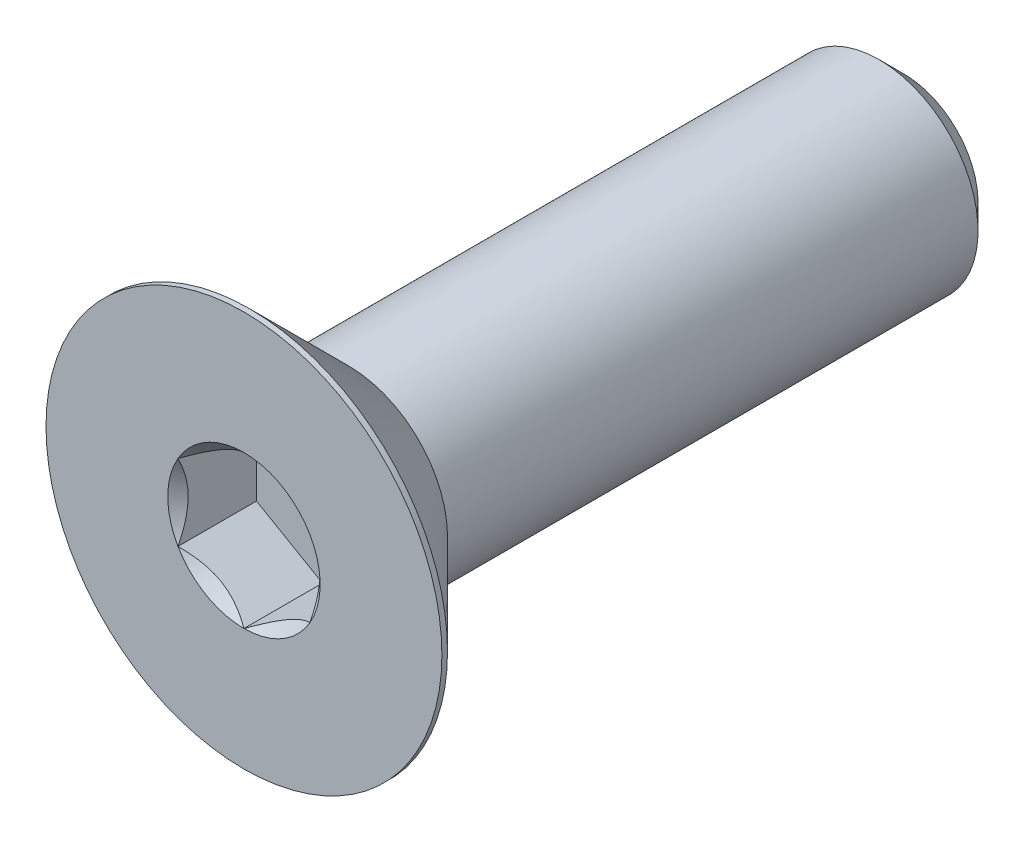
ISO-10303-21;
HEADER;
FILE_DESCRIPTION(('STEP AP214'),'2;1');
FILE_NAME('part.step','',(''),(''),'','','');
FILE_SCHEMA(('AUTOMOTIVE_DESIGN { 1 0 10303 214 1 1 1 1 }'));
ENDSEC;
DATA;
#1=APPLICATION_CONTEXT('core data for automotive mechanical design processes');
#2=APPLICATION_PROTOCOL_DEFINITION('international standard','automotive_design',2000,#1);
#3=PRODUCT_CONTEXT('',#1,'mechanical');
#4=PRODUCT('Part','Part','',(#3));
#5=PRODUCT_RELATED_PRODUCT_CATEGORY('part','',(#4));
#6=PRODUCT_DEFINITION_FORMATION('','',#4);
#7=PRODUCT_DEFINITION_CONTEXT('part definition',#1,'design');
#8=PRODUCT_DEFINITION('design','',#6,#7);
#9=PRODUCT_DEFINITION_SHAPE('','',#8);
#10=(LENGTH_UNIT() NAMED_UNIT(*) SI_UNIT(.MILLI.,.METRE.));
#11=(NAMED_UNIT(*) PLANE_ANGLE_UNIT() SI_UNIT($,.RADIAN.));
#12=(NAMED_UNIT(*) SI_UNIT($,.STERADIAN.) SOLID_ANGLE_UNIT());
#13=UNCERTAINTY_MEASURE_WITH_UNIT(LENGTH_MEASURE(1.E-05),#10,'distance_accuracy_value','');
#14=(GEOMETRIC_REPRESENTATION_CONTEXT(3) GLOBAL_UNCERTAINTY_ASSIGNED_CONTEXT((#13)) GLOBAL_UNIT_ASSIGNED_CONTEXT((#10,
#11,#12)) REPRESENTATION_CONTEXT('',''));
#15=CARTESIAN_POINT('',(0.,0.,0.));
#16=DIRECTION('',(0.,0.,1.));
#17=DIRECTION('',(1.,0.,0.));
#18=AXIS2_PLACEMENT_3D('',#15,#16,#17);
#19=CARTESIAN_POINT('',(0.,0.,5.));
#20=DIRECTION('',(0.,0.,-1.));
#21=DIRECTION('',(0.,1.,0.));
#22=AXIS2_PLACEMENT_3D('',#19,#20,#21);
#23=PLANE('',#22);
#24=CARTESIAN_POINT('',(0.,0.,5.));
#25=DIRECTION('',(0.,0.,1.));
#26=DIRECTION('',(0.,-1.,0.));
#27=AXIS2_PLACEMENT_3D('',#24,#25,#26);
#28=CIRCLE('',#27,3.);
#29=CARTESIAN_POINT('',(0.,-3.,5.));
#30=VERTEX_POINT('',#29);
#31=EDGE_CURVE('E232',#30,#30,#28,.T.);
#32=ORIENTED_EDGE('',*,*,#31,.T.);
#33=EDGE_LOOP('',(#32));
#34=FACE_BOUND('',#33,.T.);
#35=CARTESIAN_POINT('',(0.,0.,5.));
#36=DIRECTION('',(0.,0.,-1.));
#37=DIRECTION('',(-1.,0.,0.));
#38=AXIS2_PLACEMENT_3D('',#35,#36,#37);
#39=CIRCLE('',#38,1.15470053837925);
#40=CARTESIAN_POINT('',(-1.,0.577350269189623,5.));
#41=VERTEX_POINT('',#40);
#42=CARTESIAN_POINT('',(0.,1.15470053837925,5.));
#43=VERTEX_POINT('',#42);
#44=EDGE_CURVE('E146',#41,#43,#39,.T.);
#45=ORIENTED_EDGE('',*,*,#44,.T.);
#46=CARTESIAN_POINT('',(1.,0.577350269189625,5.));
#47=VERTEX_POINT('',#46);
#48=EDGE_CURVE('E145',#43,#47,#39,.T.);
#49=ORIENTED_EDGE('',*,*,#48,.T.);
#50=CARTESIAN_POINT('',(1.,-0.577350269189626,5.));
#51=VERTEX_POINT('',#50);
#52=EDGE_CURVE('E117',#47,#51,#39,.T.);
#53=ORIENTED_EDGE('',*,*,#52,.T.);
#54=CARTESIAN_POINT('',(0.,-1.15470053837925,5.));
#55=VERTEX_POINT('',#54);
#56=EDGE_CURVE('E110',#51,#55,#39,.T.);
#57=ORIENTED_EDGE('',*,*,#56,.T.);
#58=CARTESIAN_POINT('',(-1.,-0.577350269189627,5.));
#59=VERTEX_POINT('',#58);
#60=EDGE_CURVE('E71',#55,#59,#39,.T.);
#61=ORIENTED_EDGE('',*,*,#60,.T.);
#62=EDGE_CURVE('E78',#59,#41,#39,.T.);
#63=ORIENTED_EDGE('',*,*,#62,.T.);
#64=EDGE_LOOP('',(#45,#49,#53,#57,#61,#63));
#65=FACE_BOUND('',#64,.T.);
#66=ADVANCED_FACE('F51',(#34,#65),#23,.F.);
#67=CARTESIAN_POINT('',(0.,0.,4.915));
#68=DIRECTION('',(0.,0.,1.));
#69=DIRECTION('',(0.,-1.,0.));
#70=AXIS2_PLACEMENT_3D('',#67,#68,#69);
#71=CONICAL_SURFACE('',#70,3.,0.785398163397448);
#72=CARTESIAN_POINT('',(0.,0.,3.3));
#73=DIRECTION('',(0.,0.,1.));
#74=DIRECTION('',(0.,-1.,0.));
#75=AXIS2_PLACEMENT_3D('',#72,#73,#74);
#76=CIRCLE('',#75,1.385);
#77=CARTESIAN_POINT('',(0.,-1.385,3.3));
#78=VERTEX_POINT('',#77);
#79=EDGE_CURVE('E233',#78,#78,#76,.T.);
#80=ORIENTED_EDGE('',*,*,#79,.T.);
#81=EDGE_LOOP('',(#80));
#82=FACE_BOUND('',#81,.T.);
#83=CARTESIAN_POINT('',(0.,0.,4.915));
#84=DIRECTION('',(0.,0.,1.));
#85=DIRECTION('',(0.,-1.,0.));
#86=AXIS2_PLACEMENT_3D('',#83,#84,#85);
#87=CIRCLE('',#86,3.);
#88=CARTESIAN_POINT('',(0.,-3.,4.915));
#89=VERTEX_POINT('',#88);
#90=EDGE_CURVE('E65',#89,#89,#87,.T.);
#91=ORIENTED_EDGE('',*,*,#90,.F.);
#92=EDGE_LOOP('',(#91));
#93=FACE_BOUND('',#92,.T.);
#94=ADVANCED_FACE('F53',(#82,#93),#71,.T.);
#95=CARTESIAN_POINT('',(0.,0.,5.));
#96=DIRECTION('',(0.,0.,1.));
#97=DIRECTION('',(0.,-1.,0.));
#98=AXIS2_PLACEMENT_3D('',#95,#96,#97);
#99=CYLINDRICAL_SURFACE('',#98,3.);
#100=ORIENTED_EDGE('',*,*,#90,.T.);
#101=EDGE_LOOP('',(#100));
#102=FACE_BOUND('',#101,.T.);
#103=ORIENTED_EDGE('',*,*,#31,.F.);
#104=EDGE_LOOP('',(#103));
#105=FACE_BOUND('',#104,.T.);
#106=ADVANCED_FACE('F217',(#102,#105),#99,.T.);
#107=CARTESIAN_POINT('',(0.,0.,3.3));
#108=DIRECTION('',(0.,0.,-1.));
#109=DIRECTION('',(0.,1.,0.));
#110=AXIS2_PLACEMENT_3D('',#107,#108,#109);
#111=PLANE('',#110);
#112=ORIENTED_EDGE('',*,*,#79,.F.);
#113=EDGE_LOOP('',(#112));
#114=FACE_BOUND('',#113,.T.);
#115=ADVANCED_FACE('F221',(#114),#111,.T.);
#116=CARTESIAN_POINT('',(0.,0.,5.));
#117=DIRECTION('',(0.,0.,1.));
#118=DIRECTION('',(-1.,0.,0.));
#119=AXIS2_PLACEMENT_3D('',#116,#117,#118);
#120=CONICAL_SURFACE('',#119,1.15470053837925,0.78539816339745);
#121=CARTESIAN_POINT('',(1.,-1.15147208646462,5.37038567751387));
#122=CARTESIAN_POINT('',(1.,-1.12343447988552,5.34921991987372));
#123=CARTESIAN_POINT('',(1.,-1.09524064850697,5.32826169217592));
#124=CARTESIAN_POINT('',(1.,-1.03847715644377,5.28684602223563));
#125=CARTESIAN_POINT('',(1.,-1.00990740382975,5.26638870612366));
#126=CARTESIAN_POINT('',(1.,-0.92312089433348,5.20560479495451));
#127=CARTESIAN_POINT('',(1.,-0.864253173759063,5.1661922289614));
#128=CARTESIAN_POINT('',(1.,-0.740809858258048,5.08882066420021));
#129=CARTESIAN_POINT('',(1.,-0.67610025513781,5.05107303911435));
#130=CARTESIAN_POINT('',(1.,-0.543448939049126,4.9820245875513));
#131=CARTESIAN_POINT('',(1.,-0.475519112027781,4.95070202784687));
#132=CARTESIAN_POINT('',(1.,-0.37355585033353,4.9123817788838));
#133=CARTESIAN_POINT('',(1.,-0.341031989670909,4.90138359164216));
#134=CARTESIAN_POINT('',(1.,-0.275199079052294,4.88199834214736));
#135=CARTESIAN_POINT('',(1.,-0.241889975173934,4.8736114597767));
#136=CARTESIAN_POINT('',(1.,-0.175247517042993,4.86002522071902));
#137=CARTESIAN_POINT('',(1.,-0.141925568218175,4.85477079076797));
#138=CARTESIAN_POINT('',(1.,-0.0749144362322792,4.8475486865709));
#139=CARTESIAN_POINT('',(1.,-0.0412251978501618,4.84558151361051));
#140=CARTESIAN_POINT('',(1.,0.0249580992634212,4.84508319839316));
#141=CARTESIAN_POINT('',(1.,0.0574512826460395,4.84643026788864));
#142=CARTESIAN_POINT('',(1.,0.122148505701867,4.85221648449899));
#143=CARTESIAN_POINT('',(1.,0.154352610132927,4.85665492066154));
#144=CARTESIAN_POINT('',(1.,0.21879989886764,4.86845683014521));
#145=CARTESIAN_POINT('',(1.,0.251033743268954,4.87587054103851));
#146=CARTESIAN_POINT('',(1.,0.31479713235492,4.89322894249868));
#147=CARTESIAN_POINT('',(1.,0.346326735731005,4.90317342128883));
#148=CARTESIAN_POINT('',(1.,0.445594187730206,4.93822348255434));
#149=CARTESIAN_POINT('',(1.,0.511919139476037,4.96732085835673));
#150=CARTESIAN_POINT('',(1.,0.641453244657533,5.03201532968651));
#151=CARTESIAN_POINT('',(1.,0.704650133126345,5.06763577671525));
#152=CARTESIAN_POINT('',(1.,0.825428490174987,5.14112390134694));
#153=CARTESIAN_POINT('',(1.,0.883132947867686,5.17879194713547));
#154=CARTESIAN_POINT('',(1.,0.968148853704567,5.23702285294317));
#155=CARTESIAN_POINT('',(1.,0.996120570380286,5.25663847576286));
#156=CARTESIAN_POINT('',(1.,1.05168177729902,5.29638851706128));
#157=CARTESIAN_POINT('',(1.,1.079271369977,5.31652279219884));
#158=CARTESIAN_POINT('',(1.,1.10670185346329,5.33687211907298));
#159=B_SPLINE_CURVE_WITH_KNOTS('',3,(#121,#122,#123,#124,#125,#126,#127,#128,#129,#130,#131,
#132,#133,#134,#135,#136,#137,#138,#139,#140,#141,#142,#143,#144,#145,#146,#147,#148,#149,#150,
#151,#152,#153,#154,#155,#156,#157,#158),.UNSPECIFIED.,.F.,.F.,(4,2,2,2,2,2,2,2,2,2,2,2,2,2,2,2,
2,2,4),(0.,0.105386459083291,0.210799187330125,0.423233611565469,0.647793540908504,
0.871580877738612,0.974493074181424,1.07741235827201,1.17846428203205,1.27953161415763,
1.37694086739611,1.47432772585408,1.57343322804294,1.67253043972852,1.88917353996828,
2.10660791038813,2.31323734249844,2.41572589232045,2.51818641476504),.UNSPECIFIED.);
#160=EDGE_CURVE('E12',#47,#51,#159,.F.);
#161=ORIENTED_EDGE('',*,*,#160,.T.);
#162=ORIENTED_EDGE('',*,*,#52,.F.);
#163=EDGE_LOOP('',(#161,#162));
#164=FACE_BOUND('',#163,.T.);
#165=ADVANCED_FACE('F122',(#164),#120,.F.);
#166=CARTESIAN_POINT('',(-0.000199999999999349,1.15481600843309,5.00011548737262));
#167=CARTESIAN_POINT('',(0.0341825950071816,1.13496520795026,4.98027793082573));
#168=CARTESIAN_POINT('',(0.0691401181398258,1.11478247255942,4.96160502063889));
#169=CARTESIAN_POINT('',(0.140422802956091,1.07362739529219,4.92741474272316));
#170=CARTESIAN_POINT('',(0.176754750528985,1.0526511355808,4.91191640902346));
#171=CARTESIAN_POINT('',(0.250016613803312,1.01035337909803,4.88536730714227));
#172=CARTESIAN_POINT('',(0.286927851445415,0.989042666109241,4.87424977399693));
#173=CARTESIAN_POINT('',(0.36156272931086,0.945952199282691,4.85711986577618));
#174=CARTESIAN_POINT('',(0.399284088108636,0.924173762626597,4.85109469746668));
#175=CARTESIAN_POINT('',(0.464292198417934,0.886641312640015,4.8456605549675));
#176=CARTESIAN_POINT('',(0.491494371528173,0.870936130672276,4.84485693831673));
#177=CARTESIAN_POINT('',(0.545846040669112,0.839556179862849,4.84620669941689));
#178=CARTESIAN_POINT('',(0.572995523754876,0.823881418494924,4.8483607295472));
#179=CARTESIAN_POINT('',(0.654056277326961,0.777080970599367,4.85911697212847));
#180=CARTESIAN_POINT('',(0.707564140978428,0.74618819111643,4.87201455641536));
#181=CARTESIAN_POINT('',(0.801476065143433,0.69196811641965,4.90314073060218));
#182=CARTESIAN_POINT('',(0.842320523671835,0.668386557293372,4.91973779770184));
#183=CARTESIAN_POINT('',(0.922409637381945,0.622147085933681,4.9571249246853));
#184=CARTESIAN_POINT('',(0.961659010870439,0.599486449584575,4.97790134181741));
#185=CARTESIAN_POINT('',(1.0002,0.577234799135788,5.00011548737262));
#186=B_SPLINE_CURVE_WITH_KNOTS('',3,(#166,#167,#168,#169,#170,#171,#172,#173,#174,#175,#176,
#177,#178,#179,#180,#181,#182,#183,#184,#185),.UNSPECIFIED.,.F.,.F.,(4,2,2,2,2,2,2,2,2,4),(0.,
0.133237676828559,0.26725222983449,0.3991370762693,0.530689603280768,0.624814864263846,
0.718960890149133,0.907306626112097,1.05710100361789,1.20641411519286),.UNSPECIFIED.);
#187=EDGE_CURVE('E148',#43,#47,#186,.T.);
#188=ORIENTED_EDGE('',*,*,#187,.T.);
#189=ORIENTED_EDGE('',*,*,#48,.F.);
#190=EDGE_LOOP('',(#188,#189));
#191=FACE_BOUND('',#190,.T.);
#192=ADVANCED_FACE('F271',(#191),#120,.F.);
#193=CARTESIAN_POINT('',(-1.0002,0.577234799135787,5.00011548737262));
#194=CARTESIAN_POINT('',(-0.965817404992821,0.59708559961862,4.98027793082574));
#195=CARTESIAN_POINT('',(-0.930859881860177,0.617268335009455,4.96160502063889));
#196=CARTESIAN_POINT('',(-0.859577197043912,0.658423412276685,4.92741474272316));
#197=CARTESIAN_POINT('',(-0.823245249471017,0.679399671988079,4.91191640902346));
#198=CARTESIAN_POINT('',(-0.74998338619669,0.721697428470845,4.88536730714227));
#199=CARTESIAN_POINT('',(-0.713072148554587,0.743008141459636,4.87424977399693));
#200=CARTESIAN_POINT('',(-0.638437270689141,0.786098608286186,4.85711986577618));
#201=CARTESIAN_POINT('',(-0.600715911891365,0.80787704494228,4.85109469746668));
#202=CARTESIAN_POINT('',(-0.535707801582067,0.845409494928863,4.8456605549675));
#203=CARTESIAN_POINT('',(-0.508505628471828,0.861114676896602,4.84485693831673));
#204=CARTESIAN_POINT('',(-0.454153959330888,0.892494627706029,4.84620669941689));
#205=CARTESIAN_POINT('',(-0.427004476245125,0.908169389073954,4.8483607295472));
#206=CARTESIAN_POINT('',(-0.34594372267304,0.95496983696951,4.85911697212847));
#207=CARTESIAN_POINT('',(-0.292435859021573,0.985862616452447,4.87201455641536));
#208=CARTESIAN_POINT('',(-0.198523934856569,1.04008269114923,4.90314073060218));
#209=CARTESIAN_POINT('',(-0.157679476328166,1.06366425027551,4.91973779770184));
#210=CARTESIAN_POINT('',(-0.0775903626180558,1.1099037216352,4.9571249246853));
#211=CARTESIAN_POINT('',(-0.0383409891295616,1.1325643579843,4.97790134181741));
#212=CARTESIAN_POINT('',(0.000200000000000833,1.15481600843309,5.00011548737262));
#213=B_SPLINE_CURVE_WITH_KNOTS('',3,(#193,#194,#195,#196,#197,#198,#199,#200,#201,#202,#203,
#204,#205,#206,#207,#208,#209,#210,#211,#212),.UNSPECIFIED.,.F.,.F.,(4,2,2,2,2,2,2,2,2,4),(0.,
0.133237676828559,0.267252229834491,0.399137076269301,0.53068960328077,0.624814864263848,
0.718960890149135,0.907306626112099,1.0571010036179,1.20641411519286),.UNSPECIFIED.);
#214=EDGE_CURVE('E155',#41,#43,#213,.T.);
#215=ORIENTED_EDGE('',*,*,#214,.T.);
#216=ORIENTED_EDGE('',*,*,#44,.F.);
#217=EDGE_LOOP('',(#215,#216));
#218=FACE_BOUND('',#217,.T.);
#219=ADVANCED_FACE('F267',(#218),#120,.F.);
#220=CARTESIAN_POINT('',(-1.,-1.15147208646462,5.37038567751387));
#221=CARTESIAN_POINT('',(-1.,-1.12343447988552,5.34921991987372));
#222=CARTESIAN_POINT('',(-1.,-1.09524064850698,5.32826169217592));
#223=CARTESIAN_POINT('',(-1.,-1.03847715644377,5.28684602223563));
#224=CARTESIAN_POINT('',(-1.,-1.00990740382976,5.26638870612367));
#225=CARTESIAN_POINT('',(-1.,-0.923120894333482,5.20560479495452));
#226=CARTESIAN_POINT('',(-1.,-0.864253173759064,5.1661922289614));
#227=CARTESIAN_POINT('',(-1.,-0.74080985825805,5.08882066420021));
#228=CARTESIAN_POINT('',(-1.,-0.676100255137811,5.05107303911435));
#229=CARTESIAN_POINT('',(-1.,-0.543448939049127,4.9820245875513));
#230=CARTESIAN_POINT('',(-1.,-0.475519112027781,4.95070202784687));
#231=CARTESIAN_POINT('',(-1.,-0.373555850333531,4.9123817788838));
#232=CARTESIAN_POINT('',(-1.,-0.34103198967091,4.90138359164216));
#233=CARTESIAN_POINT('',(-1.,-0.275199079052295,4.88199834214736));
#234=CARTESIAN_POINT('',(-1.,-0.241889975173935,4.8736114597767));
#235=CARTESIAN_POINT('',(-1.,-0.175247517042994,4.86002522071902));
#236=CARTESIAN_POINT('',(-1.,-0.141925568218176,4.85477079076797));
#237=CARTESIAN_POINT('',(-1.,-0.0749144362322802,4.8475486865709));
#238=CARTESIAN_POINT('',(-1.,-0.041225197850163,4.84558151361051));
#239=CARTESIAN_POINT('',(-1.,0.0249580992634198,4.84508319839316));
#240=CARTESIAN_POINT('',(-1.,0.0574512826460382,4.84643026788864));
#241=CARTESIAN_POINT('',(-1.,0.122148505701866,4.85221648449899));
#242=CARTESIAN_POINT('',(-1.,0.154352610132925,4.85665492066154));
#243=CARTESIAN_POINT('',(-1.,0.218799898867639,4.86845683014521));
#244=CARTESIAN_POINT('',(-1.,0.251033743268953,4.87587054103851));
#245=CARTESIAN_POINT('',(-1.,0.314797132354919,4.89322894249868));
#246=CARTESIAN_POINT('',(-1.,0.346326735731004,4.90317342128883));
#247=CARTESIAN_POINT('',(-1.,0.445594187730205,4.93822348255434));
#248=CARTESIAN_POINT('',(-1.,0.511919139476036,4.96732085835673));
#249=CARTESIAN_POINT('',(-1.,0.641453244657532,5.03201532968651));
#250=CARTESIAN_POINT('',(-1.,0.704650133126344,5.06763577671524));
#251=CARTESIAN_POINT('',(-1.,0.825428490174986,5.14112390134694));
#252=CARTESIAN_POINT('',(-1.,0.883132947867684,5.17879194713547));
#253=CARTESIAN_POINT('',(-1.,0.968148853704565,5.23702285294317));
#254=CARTESIAN_POINT('',(-1.,0.996120570380285,5.25663847576286));
#255=CARTESIAN_POINT('',(-1.,1.05168177729901,5.29638851706127));
#256=CARTESIAN_POINT('',(-1.,1.079271369977,5.31652279219883));
#257=CARTESIAN_POINT('',(-1.,1.10670185346329,5.33687211907297));
#258=B_SPLINE_CURVE_WITH_KNOTS('',3,(#220,#221,#222,#223,#224,#225,#226,#227,#228,#229,#230,
#231,#232,#233,#234,#235,#236,#237,#238,#239,#240,#241,#242,#243,#244,#245,#246,#247,#248,#249,
#250,#251,#252,#253,#254,#255,#256,#257),.UNSPECIFIED.,.F.,.F.,(4,2,2,2,2,2,2,2,2,2,2,2,2,2,2,2,
2,2,4),(0.,0.105386459083291,0.210799187330125,0.423233611565471,0.647793540908507,
0.871580877738615,0.974493074181426,1.07741235827202,1.17846428203205,1.27953161415763,
1.37694086739611,1.47432772585408,1.57343322804294,1.67253043972852,1.88917353996828,
2.10660791038814,2.31323734249844,2.41572589232045,2.51818641476504),.UNSPECIFIED.);
#259=EDGE_CURVE('E175',#59,#41,#258,.T.);
#260=ORIENTED_EDGE('',*,*,#259,.T.);
#261=ORIENTED_EDGE('',*,*,#62,.F.);
#262=EDGE_LOOP('',(#260,#261));
#263=FACE_BOUND('',#262,.T.);
#264=ADVANCED_FACE('F276',(#263),#120,.F.);
#265=CARTESIAN_POINT('',(0.000199999999999969,-1.15481600843309,5.00011548737262));
#266=CARTESIAN_POINT('',(-0.0341825950071806,-1.13496520795026,4.98027793082574));
#267=CARTESIAN_POINT('',(-0.0691401181398248,-1.11478247255942,4.96160502063889));
#268=CARTESIAN_POINT('',(-0.14042280295609,-1.0736273952922,4.92741474272316));
#269=CARTESIAN_POINT('',(-0.176754750528985,-1.0526511355808,4.91191640902346));
#270=CARTESIAN_POINT('',(-0.250016613803312,-1.01035337909803,4.88536730714227));
#271=CARTESIAN_POINT('',(-0.286927851445415,-0.989042666109244,4.87424977399693));
#272=CARTESIAN_POINT('',(-0.36156272931086,-0.945952199282694,4.85711986577619));
#273=CARTESIAN_POINT('',(-0.399284088108637,-0.9241737626266,4.85109469746668));
#274=CARTESIAN_POINT('',(-0.464292198417935,-0.886641312640018,4.8456605549675));
#275=CARTESIAN_POINT('',(-0.491494371528173,-0.870936130672279,4.84485693831674));
#276=CARTESIAN_POINT('',(-0.545846040669113,-0.839556179862851,4.84620669941689));
#277=CARTESIAN_POINT('',(-0.572995523754877,-0.823881418494927,4.84836072954721));
#278=CARTESIAN_POINT('',(-0.654056277326962,-0.77708097059937,4.85911697212848));
#279=CARTESIAN_POINT('',(-0.707564140978429,-0.746188191116433,4.87201455641536));
#280=CARTESIAN_POINT('',(-0.801476065143434,-0.691968116419652,4.90314073060218));
#281=CARTESIAN_POINT('',(-0.842320523671836,-0.668386557293374,4.91973779770185));
#282=CARTESIAN_POINT('',(-0.922409637381945,-0.622147085933685,4.9571249246853));
#283=CARTESIAN_POINT('',(-0.961659010870439,-0.599486449584578,4.97790134181741));
#284=CARTESIAN_POINT('',(-1.0002,-0.577234799135791,5.00011548737262));
#285=B_SPLINE_CURVE_WITH_KNOTS('',3,(#265,#266,#267,#268,#269,#270,#271,#272,#273,#274,#275,
#276,#277,#278,#279,#280,#281,#282,#283,#284),.UNSPECIFIED.,.F.,.F.,(4,2,2,2,2,2,2,2,2,4),(0.,
0.133237676828559,0.267252229834491,0.399137076269301,0.530689603280769,0.624814864263847,
0.718960890149135,0.9073066261121,1.0571010036179,1.20641411519286),.UNSPECIFIED.);
#286=EDGE_CURVE('E134',#55,#59,#285,.T.);
#287=ORIENTED_EDGE('',*,*,#286,.T.);
#288=ORIENTED_EDGE('',*,*,#60,.F.);
#289=EDGE_LOOP('',(#287,#288));
#290=FACE_BOUND('',#289,.T.);
#291=ADVANCED_FACE('F168',(#290),#120,.F.);
#292=CARTESIAN_POINT('',(1.0002,-0.57723479913579,5.00011548737262));
#293=CARTESIAN_POINT('',(0.965817404992821,-0.597085599618624,4.98027793082574));
#294=CARTESIAN_POINT('',(0.930859881860177,-0.617268335009458,4.96160502063889));
#295=CARTESIAN_POINT('',(0.859577197043912,-0.658423412276688,4.92741474272316));
#296=CARTESIAN_POINT('',(0.823245249471018,-0.679399671988082,4.91191640902346));
#297=CARTESIAN_POINT('',(0.749983386196691,-0.721697428470849,4.88536730714227));
#298=CARTESIAN_POINT('',(0.713072148554588,-0.743008141459639,4.87424977399693));
#299=CARTESIAN_POINT('',(0.638437270689143,-0.786098608286188,4.85711986577619));
#300=CARTESIAN_POINT('',(0.600715911891366,-0.807877044942283,4.85109469746668));
#301=CARTESIAN_POINT('',(0.535707801582069,-0.845409494928865,4.8456605549675));
#302=CARTESIAN_POINT('',(0.50850562847183,-0.861114676896604,4.84485693831674));
#303=CARTESIAN_POINT('',(0.45415395933089,-0.892494627706031,4.84620669941689));
#304=CARTESIAN_POINT('',(0.427004476245126,-0.908169389073956,4.8483607295472));
#305=CARTESIAN_POINT('',(0.345943722673041,-0.954969836969514,4.85911697212848));
#306=CARTESIAN_POINT('',(0.292435859021574,-0.98586261645245,4.87201455641536));
#307=CARTESIAN_POINT('',(0.19852393485657,-1.04008269114923,4.90314073060218));
#308=CARTESIAN_POINT('',(0.157679476328167,-1.06366425027551,4.91973779770185));
#309=CARTESIAN_POINT('',(0.0775903626180568,-1.1099037216352,4.9571249246853));
#310=CARTESIAN_POINT('',(0.0383409891295625,-1.13256435798431,4.97790134181741));
#311=CARTESIAN_POINT('',(-0.0001999999999999,-1.15481600843309,5.00011548737262));
#312=B_SPLINE_CURVE_WITH_KNOTS('',3,(#292,#293,#294,#295,#296,#297,#298,#299,#300,#301,#302,
#303,#304,#305,#306,#307,#308,#309,#310,#311),.UNSPECIFIED.,.F.,.F.,(4,2,2,2,2,2,2,2,2,4),(0.,
0.133237676828559,0.26725222983449,0.3991370762693,0.530689603280768,0.624814864263846,
0.718960890149133,0.907306626112098,1.0571010036179,1.20641411519286),.UNSPECIFIED.);
#313=EDGE_CURVE('E113',#51,#55,#312,.T.);
#314=ORIENTED_EDGE('',*,*,#313,.T.);
#315=ORIENTED_EDGE('',*,*,#56,.F.);
#316=EDGE_LOOP('',(#314,#315));
#317=FACE_BOUND('',#316,.T.);
#318=ADVANCED_FACE('F111',(#317),#120,.F.);
#319=CARTESIAN_POINT('',(1.,-0.577350269189628,3.81));
#320=DIRECTION('',(0.,0.,1.));
#321=DIRECTION('',(1.,0.,0.));
#322=AXIS2_PLACEMENT_3D('',#319,#320,#321);
#323=PLANE('',#322);
#324=DIRECTION('',(0.866025403784438,0.5,0.));
#325=VECTOR('',#324,1.);
#326=CARTESIAN_POINT('',(0.,-1.15470053837926,3.81));
#327=LINE('',#326,#325);
#328=CARTESIAN_POINT('',(0.,-1.15470053837926,3.81));
#329=VERTEX_POINT('',#328);
#330=CARTESIAN_POINT('',(1.,-0.577350269189628,3.81));
#331=VERTEX_POINT('',#330);
#332=EDGE_CURVE('E133',#329,#331,#327,.T.);
#333=ORIENTED_EDGE('',*,*,#332,.T.);
#334=DIRECTION('',(0.,1.,0.));
#335=VECTOR('',#334,1.);
#336=CARTESIAN_POINT('',(1.,-0.577350269189628,3.81));
#337=LINE('',#336,#335);
#338=CARTESIAN_POINT('',(1.,0.577350269189625,3.81));
#339=VERTEX_POINT('',#338);
#340=EDGE_CURVE('E138',#331,#339,#337,.T.);
#341=ORIENTED_EDGE('',*,*,#340,.T.);
#342=DIRECTION('',(-0.866025403784439,0.5,0.));
#343=VECTOR('',#342,1.);
#344=CARTESIAN_POINT('',(1.,0.577350269189625,3.81));
#345=LINE('',#344,#343);
#346=CARTESIAN_POINT('',(0.,1.15470053837925,3.81));
#347=VERTEX_POINT('',#346);
#348=EDGE_CURVE('E257',#339,#347,#345,.T.);
#349=ORIENTED_EDGE('',*,*,#348,.T.);
#350=DIRECTION('',(-0.866025403784439,-0.5,0.));
#351=VECTOR('',#350,1.);
#352=CARTESIAN_POINT('',(0.,1.15470053837925,3.81));
#353=LINE('',#352,#351);
#354=CARTESIAN_POINT('',(-1.,0.577350269189625,3.81));
#355=VERTEX_POINT('',#354);
#356=EDGE_CURVE('E254',#347,#355,#353,.T.);
#357=ORIENTED_EDGE('',*,*,#356,.T.);
#358=DIRECTION('',(0.,-1.,0.));
#359=VECTOR('',#358,1.);
#360=CARTESIAN_POINT('',(-1.,0.577350269189625,3.81));
#361=LINE('',#360,#359);
#362=CARTESIAN_POINT('',(-1.,-0.577350269189629,3.81));
#363=VERTEX_POINT('',#362);
#364=EDGE_CURVE('E251',#355,#363,#361,.T.);
#365=ORIENTED_EDGE('',*,*,#364,.T.);
#366=DIRECTION('',(0.866025403784439,-0.5,0.));
#367=VECTOR('',#366,1.);
#368=CARTESIAN_POINT('',(-1.,-0.577350269189629,3.81));
#369=LINE('',#368,#367);
#370=EDGE_CURVE('E141',#363,#329,#369,.T.);
#371=ORIENTED_EDGE('',*,*,#370,.T.);
#372=EDGE_LOOP('',(#333,#341,#349,#357,#365,#371));
#373=FACE_BOUND('',#372,.T.);
#374=ADVANCED_FACE('F167',(#373),#323,.T.);
#375=CARTESIAN_POINT('',(1.,-0.577350269189628,3.81));
#376=DIRECTION('',(1.,0.,0.));
#377=DIRECTION('',(0.,1.,0.));
#378=AXIS2_PLACEMENT_3D('',#375,#376,#377);
#379=PLANE('',#378);
#380=ORIENTED_EDGE('',*,*,#160,.F.);
#381=DIRECTION('',(0.,0.,1.));
#382=VECTOR('',#381,1.);
#383=CARTESIAN_POINT('',(1.,0.577350269189625,3.81));
#384=LINE('',#383,#382);
#385=EDGE_CURVE('E140',#339,#47,#384,.T.);
#386=ORIENTED_EDGE('',*,*,#385,.F.);
#387=ORIENTED_EDGE('',*,*,#340,.F.);
#388=DIRECTION('',(0.,0.,1.));
#389=VECTOR('',#388,1.);
#390=CARTESIAN_POINT('',(1.,-0.577350269189628,3.81));
#391=LINE('',#390,#389);
#392=EDGE_CURVE('E130',#331,#51,#391,.T.);
#393=ORIENTED_EDGE('',*,*,#392,.T.);
#394=EDGE_LOOP('',(#380,#386,#387,#393));
#395=FACE_BOUND('',#394,.T.);
#396=ADVANCED_FACE('F136',(#395),#379,.F.);
#397=CARTESIAN_POINT('',(1.,0.577350269189625,3.81));
#398=DIRECTION('',(0.5,0.866025403784439,0.));
#399=DIRECTION('',(-0.866025403784439,0.5,0.));
#400=AXIS2_PLACEMENT_3D('',#397,#398,#399);
#401=PLANE('',#400);
#402=ORIENTED_EDGE('',*,*,#187,.F.);
#403=DIRECTION('',(0.,0.,1.));
#404=VECTOR('',#403,1.);
#405=CARTESIAN_POINT('',(0.,1.15470053837925,3.81));
#406=LINE('',#405,#404);
#407=EDGE_CURVE('E239',#347,#43,#406,.T.);
#408=ORIENTED_EDGE('',*,*,#407,.F.);
#409=ORIENTED_EDGE('',*,*,#348,.F.);
#410=ORIENTED_EDGE('',*,*,#385,.T.);
#411=EDGE_LOOP('',(#402,#408,#409,#410));
#412=FACE_BOUND('',#411,.T.);
#413=ADVANCED_FACE('F162',(#412),#401,.F.);
#414=CARTESIAN_POINT('',(0.,1.15470053837925,3.81));
#415=DIRECTION('',(-0.5,0.866025403784439,0.));
#416=DIRECTION('',(-0.866025403784439,-0.5,0.));
#417=AXIS2_PLACEMENT_3D('',#414,#415,#416);
#418=PLANE('',#417);
#419=ORIENTED_EDGE('',*,*,#214,.F.);
#420=DIRECTION('',(0.,0.,1.));
#421=VECTOR('',#420,1.);
#422=CARTESIAN_POINT('',(-1.,0.577350269189625,3.81));
#423=LINE('',#422,#421);
#424=EDGE_CURVE('E242',#355,#41,#423,.T.);
#425=ORIENTED_EDGE('',*,*,#424,.F.);
#426=ORIENTED_EDGE('',*,*,#356,.F.);
#427=ORIENTED_EDGE('',*,*,#407,.T.);
#428=EDGE_LOOP('',(#419,#425,#426,#427));
#429=FACE_BOUND('',#428,.T.);
#430=ADVANCED_FACE('F199',(#429),#418,.F.);
#431=CARTESIAN_POINT('',(-1.,0.577350269189625,3.81));
#432=DIRECTION('',(-1.,0.,0.));
#433=DIRECTION('',(0.,-1.,0.));
#434=AXIS2_PLACEMENT_3D('',#431,#432,#433);
#435=PLANE('',#434);
#436=ORIENTED_EDGE('',*,*,#259,.F.);
#437=DIRECTION('',(0.,0.,1.));
#438=VECTOR('',#437,1.);
#439=CARTESIAN_POINT('',(-1.,-0.577350269189629,3.81));
#440=LINE('',#439,#438);
#441=EDGE_CURVE('E245',#363,#59,#440,.T.);
#442=ORIENTED_EDGE('',*,*,#441,.F.);
#443=ORIENTED_EDGE('',*,*,#364,.F.);
#444=ORIENTED_EDGE('',*,*,#424,.T.);
#445=EDGE_LOOP('',(#436,#442,#443,#444));
#446=FACE_BOUND('',#445,.T.);
#447=ADVANCED_FACE('F195',(#446),#435,.F.);
#448=CARTESIAN_POINT('',(-1.,-0.577350269189629,3.81));
#449=DIRECTION('',(-0.5,-0.866025403784439,0.));
#450=DIRECTION('',(0.866025403784439,-0.5,0.));
#451=AXIS2_PLACEMENT_3D('',#448,#449,#450);
#452=PLANE('',#451);
#453=ORIENTED_EDGE('',*,*,#286,.F.);
#454=DIRECTION('',(0.,0.,1.));
#455=VECTOR('',#454,1.);
#456=CARTESIAN_POINT('',(0.,-1.15470053837926,3.81));
#457=LINE('',#456,#455);
#458=EDGE_CURVE('E132',#329,#55,#457,.T.);
#459=ORIENTED_EDGE('',*,*,#458,.F.);
#460=ORIENTED_EDGE('',*,*,#370,.F.);
#461=ORIENTED_EDGE('',*,*,#441,.T.);
#462=EDGE_LOOP('',(#453,#459,#460,#461));
#463=FACE_BOUND('',#462,.T.);
#464=ADVANCED_FACE('F192',(#463),#452,.F.);
#465=CARTESIAN_POINT('',(0.,-1.15470053837926,3.81));
#466=DIRECTION('',(0.5,-0.866025403784439,0.));
#467=DIRECTION('',(0.866025403784439,0.5,0.));
#468=AXIS2_PLACEMENT_3D('',#465,#466,#467);
#469=PLANE('',#468);
#470=ORIENTED_EDGE('',*,*,#313,.F.);
#471=ORIENTED_EDGE('',*,*,#392,.F.);
#472=ORIENTED_EDGE('',*,*,#332,.F.);
#473=ORIENTED_EDGE('',*,*,#458,.T.);
#474=EDGE_LOOP('',(#470,#471,#472,#473));
#475=FACE_BOUND('',#474,.T.);
#476=ADVANCED_FACE('F128',(#475),#469,.F.);
#477=CLOSED_SHELL('',(#66,#94,#106,#115,#165,#192,#219,#264,#291,#318,#374,#396,#413,#430,#447,
#464,#476));
#478=MANIFOLD_SOLID_BREP('B2',#477);
#479=CARTESIAN_POINT('',(0.,-1.50000000000001,3.81000000000001));
#480=DIRECTION('',(0.,0.,-1.));
#481=DIRECTION('',(0.,1.,0.));
#482=AXIS2_PLACEMENT_3D('',#479,#480,#481);
#483=PLANE('',#482);
#484=CARTESIAN_POINT('',(0.,0.,3.81000000000001));
#485=DIRECTION('',(0.,0.,1.));
#486=DIRECTION('',(0.,-1.,0.));
#487=AXIS2_PLACEMENT_3D('',#484,#485,#486);
#488=CIRCLE('',#487,1.50000000000001);
#489=CARTESIAN_POINT('',(0.,-1.50000000000001,3.81000000000001));
#490=VERTEX_POINT('',#489);
#491=EDGE_CURVE('E361',#490,#490,#488,.T.);
#492=ORIENTED_EDGE('',*,*,#491,.T.);
#493=EDGE_LOOP('',(#492));
#494=FACE_BOUND('',#493,.T.);
#495=ADVANCED_FACE('F348',(#494),#483,.F.);
#496=CARTESIAN_POINT('',(0.,-1.5,-5.00000000000001));
#497=DIRECTION('',(0.,0.,1.));
#498=DIRECTION('',(0.,-1.,0.));
#499=AXIS2_PLACEMENT_3D('',#496,#497,#498);
#500=PLANE('',#499);
#501=CARTESIAN_POINT('',(0.,0.,-5.00000000000001));
#502=DIRECTION('',(0.,0.,1.));
#503=DIRECTION('',(0.,-1.,0.));
#504=AXIS2_PLACEMENT_3D('',#501,#502,#503);
#505=CIRCLE('',#504,1.125);
#506=CARTESIAN_POINT('',(0.,-1.125,-5.00000000000001));
#507=VERTEX_POINT('',#506);
#508=EDGE_CURVE('E50',#507,#507,#505,.F.);
#509=ORIENTED_EDGE('',*,*,#508,.T.);
#510=EDGE_LOOP('',(#509));
#511=FACE_BOUND('',#510,.T.);
#512=ADVANCED_FACE('F372',(#511),#500,.F.);
#513=CARTESIAN_POINT('',(0.,0.,3.81));
#514=DIRECTION('',(0.,0.,1.));
#515=DIRECTION('',(0.,-1.,0.));
#516=AXIS2_PLACEMENT_3D('',#513,#514,#515);
#517=CYLINDRICAL_SURFACE('',#516,1.50000000000001);
#518=CARTESIAN_POINT('',(0.,0.,-4.62500000000001));
#519=DIRECTION('',(0.,0.,1.));
#520=DIRECTION('',(0.,-1.,0.));
#521=AXIS2_PLACEMENT_3D('',#518,#519,#520);
#522=CIRCLE('',#521,1.50000000000001);
#523=CARTESIAN_POINT('',(0.,-1.50000000000001,-4.62500000000001));
#524=VERTEX_POINT('',#523);
#525=EDGE_CURVE('E356',#524,#524,#522,.T.);
#526=ORIENTED_EDGE('',*,*,#525,.T.);
#527=EDGE_LOOP('',(#526));
#528=FACE_BOUND('',#527,.T.);
#529=ORIENTED_EDGE('',*,*,#491,.F.);
#530=EDGE_LOOP('',(#529));
#531=FACE_BOUND('',#530,.T.);
#532=ADVANCED_FACE('F370',(#528,#531),#517,.T.);
#533=CARTESIAN_POINT('',(0.,0.,-4.62500000000001));
#534=DIRECTION('',(0.,0.,1.));
#535=DIRECTION('',(0.,-1.,0.));
#536=AXIS2_PLACEMENT_3D('',#533,#534,#535);
#537=CONICAL_SURFACE('',#536,1.50000000000001,0.785398163397452);
#538=ORIENTED_EDGE('',*,*,#508,.F.);
#539=EDGE_LOOP('',(#538));
#540=FACE_BOUND('',#539,.T.);
#541=ORIENTED_EDGE('',*,*,#525,.F.);
#542=EDGE_LOOP('',(#541));
#543=FACE_BOUND('',#542,.T.);
#544=ADVANCED_FACE('F350',(#540,#543),#537,.T.);
#545=CLOSED_SHELL('',(#495,#512,#532,#544));
#546=MANIFOLD_SOLID_BREP('B6',#545);
#547=ADVANCED_BREP_SHAPE_REPRESENTATION('',(#18,#478,#546),#14);
#548=SHAPE_DEFINITION_REPRESENTATION(#9,#547);
ENDSEC;
END-ISO-10303-21;
